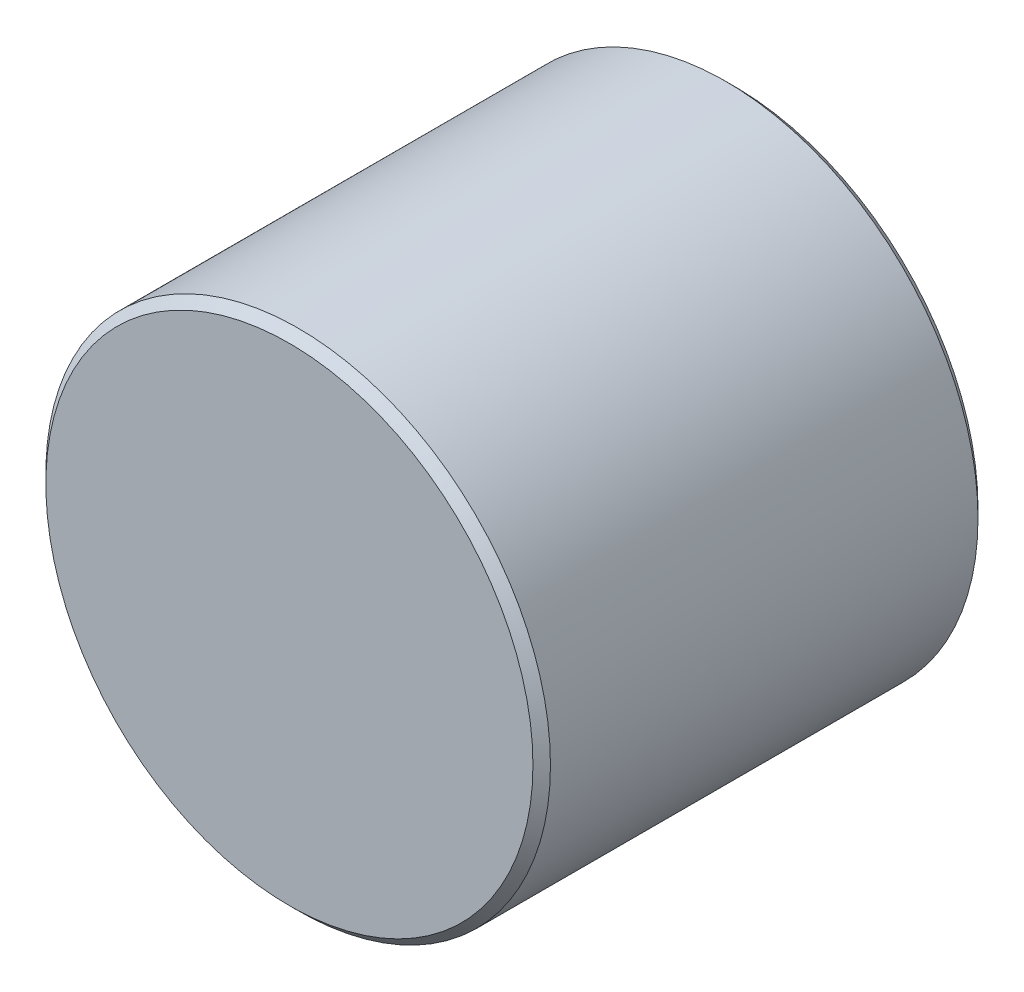
ISO-10303-21;
HEADER;
FILE_DESCRIPTION(('STEP AP214'),'2;1');
FILE_NAME('part.step','',(''),(''),'','','');
FILE_SCHEMA(('AUTOMOTIVE_DESIGN { 1 0 10303 214 1 1 1 1 }'));
ENDSEC;
DATA;
#1=APPLICATION_CONTEXT('core data for automotive mechanical design processes');
#2=APPLICATION_PROTOCOL_DEFINITION('international standard','automotive_design',2000,#1);
#3=PRODUCT_CONTEXT('',#1,'mechanical');
#4=PRODUCT('Part','Part','',(#3));
#5=PRODUCT_RELATED_PRODUCT_CATEGORY('part','',(#4));
#6=PRODUCT_DEFINITION_FORMATION('','',#4);
#7=PRODUCT_DEFINITION_CONTEXT('part definition',#1,'design');
#8=PRODUCT_DEFINITION('design','',#6,#7);
#9=PRODUCT_DEFINITION_SHAPE('','',#8);
#10=(LENGTH_UNIT() NAMED_UNIT(*) SI_UNIT(.MILLI.,.METRE.));
#11=(NAMED_UNIT(*) PLANE_ANGLE_UNIT() SI_UNIT($,.RADIAN.));
#12=(NAMED_UNIT(*) SI_UNIT($,.STERADIAN.) SOLID_ANGLE_UNIT());
#13=UNCERTAINTY_MEASURE_WITH_UNIT(LENGTH_MEASURE(1.E-05),#10,'distance_accuracy_value','');
#14=(GEOMETRIC_REPRESENTATION_CONTEXT(3) GLOBAL_UNCERTAINTY_ASSIGNED_CONTEXT((#13)) GLOBAL_UNIT_ASSIGNED_CONTEXT((#10,
#11,#12)) REPRESENTATION_CONTEXT('',''));
#15=CARTESIAN_POINT('',(0.,0.,0.));
#16=DIRECTION('',(0.,0.,1.));
#17=DIRECTION('',(1.,0.,0.));
#18=AXIS2_PLACEMENT_3D('',#15,#16,#17);
#19=CARTESIAN_POINT('',(0.,0.,6.35));
#20=DIRECTION('',(0.,0.,-1.));
#21=DIRECTION('',(-1.,0.,0.));
#22=AXIS2_PLACEMENT_3D('',#19,#20,#21);
#23=CYLINDRICAL_SURFACE('',#22,7.2);
#24=CARTESIAN_POINT('',(0.,0.,-6.1));
#25=DIRECTION('',(0.,0.,1.));
#26=DIRECTION('',(1.,0.,0.));
#27=AXIS2_PLACEMENT_3D('',#24,#25,#26);
#28=CIRCLE('',#27,7.2);
#29=CARTESIAN_POINT('',(7.2,0.,-6.1));
#30=VERTEX_POINT('',#29);
#31=EDGE_CURVE('E29',#30,#30,#28,.T.);
#32=ORIENTED_EDGE('',*,*,#31,.T.);
#33=EDGE_LOOP('',(#32));
#34=FACE_BOUND('',#33,.T.);
#35=CARTESIAN_POINT('',(0.,0.,6.09999999999999));
#36=DIRECTION('',(0.,0.,1.));
#37=DIRECTION('',(1.,0.,0.));
#38=AXIS2_PLACEMENT_3D('',#35,#36,#37);
#39=CIRCLE('',#38,7.2);
#40=CARTESIAN_POINT('',(7.2,0.,6.09999999999999));
#41=VERTEX_POINT('',#40);
#42=EDGE_CURVE('E35',#41,#41,#39,.F.);
#43=ORIENTED_EDGE('',*,*,#42,.T.);
#44=EDGE_LOOP('',(#43));
#45=FACE_BOUND('',#44,.T.);
#46=ADVANCED_FACE('F14',(#34,#45),#23,.T.);
#47=CARTESIAN_POINT('',(0.,0.,6.35));
#48=DIRECTION('',(0.,0.,1.));
#49=DIRECTION('',(1.,0.,0.));
#50=AXIS2_PLACEMENT_3D('',#47,#48,#49);
#51=PLANE('',#50);
#52=CARTESIAN_POINT('',(0.,0.,6.35));
#53=DIRECTION('',(0.,0.,1.));
#54=DIRECTION('',(1.,0.,0.));
#55=AXIS2_PLACEMENT_3D('',#52,#53,#54);
#56=CIRCLE('',#55,6.94999999999999);
#57=CARTESIAN_POINT('',(6.94999999999999,0.,6.35));
#58=VERTEX_POINT('',#57);
#59=EDGE_CURVE('E9',#58,#58,#56,.T.);
#60=ORIENTED_EDGE('',*,*,#59,.T.);
#61=EDGE_LOOP('',(#60));
#62=FACE_BOUND('',#61,.T.);
#63=ADVANCED_FACE('F54',(#62),#51,.T.);
#64=CARTESIAN_POINT('',(0.,0.,-6.35));
#65=DIRECTION('',(0.,0.,1.));
#66=DIRECTION('',(1.,0.,0.));
#67=AXIS2_PLACEMENT_3D('',#64,#65,#66);
#68=PLANE('',#67);
#69=CARTESIAN_POINT('',(0.,0.,-6.35));
#70=DIRECTION('',(0.,0.,1.));
#71=DIRECTION('',(1.,0.,0.));
#72=AXIS2_PLACEMENT_3D('',#69,#70,#71);
#73=CIRCLE('',#72,6.95);
#74=CARTESIAN_POINT('',(6.95,0.,-6.35));
#75=VERTEX_POINT('',#74);
#76=EDGE_CURVE('E22',#75,#75,#73,.F.);
#77=ORIENTED_EDGE('',*,*,#76,.T.);
#78=EDGE_LOOP('',(#77));
#79=FACE_BOUND('',#78,.T.);
#80=ADVANCED_FACE('F51',(#79),#68,.F.);
#81=CARTESIAN_POINT('',(0.,0.,-6.1));
#82=DIRECTION('',(0.,0.,1.));
#83=DIRECTION('',(1.,0.,0.));
#84=AXIS2_PLACEMENT_3D('',#81,#82,#83);
#85=CONICAL_SURFACE('',#84,7.2,0.785398163397448);
#86=ORIENTED_EDGE('',*,*,#76,.F.);
#87=EDGE_LOOP('',(#86));
#88=FACE_BOUND('',#87,.T.);
#89=ORIENTED_EDGE('',*,*,#31,.F.);
#90=EDGE_LOOP('',(#89));
#91=FACE_BOUND('',#90,.T.);
#92=ADVANCED_FACE('F46',(#88,#91),#85,.T.);
#93=CARTESIAN_POINT('',(0.,0.,6.35));
#94=DIRECTION('',(0.,0.,-1.));
#95=DIRECTION('',(-1.,0.,0.));
#96=AXIS2_PLACEMENT_3D('',#93,#94,#95);
#97=CONICAL_SURFACE('',#96,6.94999999999999,0.785398163397448);
#98=ORIENTED_EDGE('',*,*,#42,.F.);
#99=EDGE_LOOP('',(#98));
#100=FACE_BOUND('',#99,.T.);
#101=ORIENTED_EDGE('',*,*,#59,.F.);
#102=EDGE_LOOP('',(#101));
#103=FACE_BOUND('',#102,.T.);
#104=ADVANCED_FACE('F16',(#100,#103),#97,.T.);
#105=CLOSED_SHELL('',(#46,#63,#80,#92,#104));
#106=MANIFOLD_SOLID_BREP('B1',#105);
#107=ADVANCED_BREP_SHAPE_REPRESENTATION('',(#18,#106),#14);
#108=SHAPE_DEFINITION_REPRESENTATION(#9,#107);
ENDSEC;
END-ISO-10303-21;
